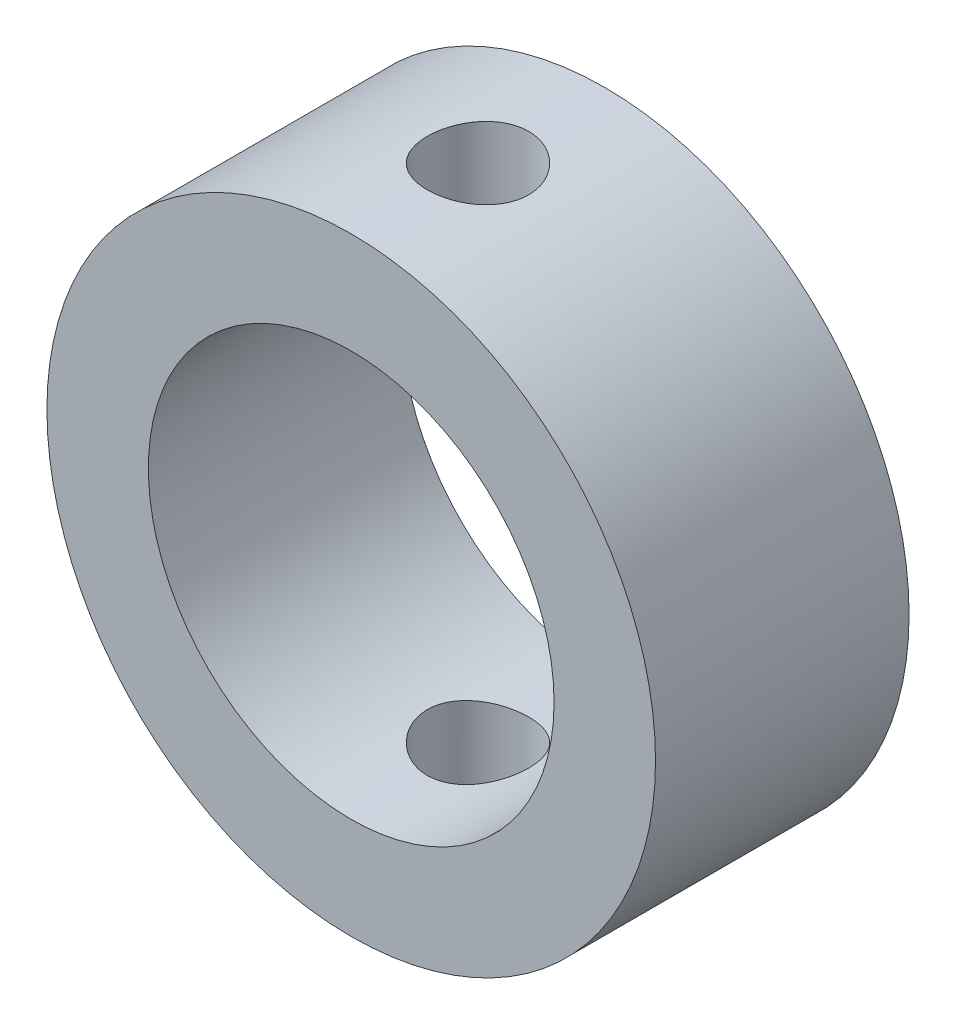
ISO-10303-21;
HEADER;
FILE_DESCRIPTION(('STEP AP214'),'2;1');
FILE_NAME('part.step','',(''),(''),'','','');
FILE_SCHEMA(('AUTOMOTIVE_DESIGN { 1 0 10303 214 1 1 1 1 }'));
ENDSEC;
DATA;
#1=APPLICATION_CONTEXT('core data for automotive mechanical design processes');
#2=APPLICATION_PROTOCOL_DEFINITION('international standard','automotive_design',2000,#1);
#3=PRODUCT_CONTEXT('',#1,'mechanical');
#4=PRODUCT('Part','Part','',(#3));
#5=PRODUCT_RELATED_PRODUCT_CATEGORY('part','',(#4));
#6=PRODUCT_DEFINITION_FORMATION('','',#4);
#7=PRODUCT_DEFINITION_CONTEXT('part definition',#1,'design');
#8=PRODUCT_DEFINITION('design','',#6,#7);
#9=PRODUCT_DEFINITION_SHAPE('','',#8);
#10=(LENGTH_UNIT() NAMED_UNIT(*) SI_UNIT(.MILLI.,.METRE.));
#11=(NAMED_UNIT(*) PLANE_ANGLE_UNIT() SI_UNIT($,.RADIAN.));
#12=(NAMED_UNIT(*) SI_UNIT($,.STERADIAN.) SOLID_ANGLE_UNIT());
#13=UNCERTAINTY_MEASURE_WITH_UNIT(LENGTH_MEASURE(1.E-05),#10,'distance_accuracy_value','');
#14=(GEOMETRIC_REPRESENTATION_CONTEXT(3) GLOBAL_UNCERTAINTY_ASSIGNED_CONTEXT((#13)) GLOBAL_UNIT_ASSIGNED_CONTEXT((#10,
#11,#12)) REPRESENTATION_CONTEXT('',''));
#15=CARTESIAN_POINT('',(0.,0.,0.));
#16=DIRECTION('',(0.,0.,1.));
#17=DIRECTION('',(1.,0.,0.));
#18=AXIS2_PLACEMENT_3D('',#15,#16,#17);
#19=CARTESIAN_POINT('',(0.,0.,7.5));
#20=DIRECTION('',(0.,0.,-1.));
#21=DIRECTION('',(-1.,0.,0.));
#22=AXIS2_PLACEMENT_3D('',#19,#20,#21);
#23=CYLINDRICAL_SURFACE('',#22,9.);
#24=CARTESIAN_POINT('',(0.,-9.,2.25));
#25=CARTESIAN_POINT('',(0.0836345429749289,-8.99999856701294,2.25000335336869));
#26=CARTESIAN_POINT('',(0.167314729103293,-8.9988220674782,2.25701836498135));
#27=CARTESIAN_POINT('',(0.332328133003826,-8.99424206964832,2.28488139525919));
#28=CARTESIAN_POINT('',(0.413659120775548,-8.99083652354334,2.30574213414696));
#29=CARTESIAN_POINT('',(0.571562848327586,-8.9821804094187,2.36064926915565));
#30=CARTESIAN_POINT('',(0.648139421059141,-8.97693135095516,2.39468487938434));
#31=CARTESIAN_POINT('',(0.794485105186767,-8.96516536249242,2.47494737523144));
#32=CARTESIAN_POINT('',(0.864254993927155,-8.9586485775266,2.5211728664898));
#33=CARTESIAN_POINT('',(0.995683568575008,-8.94499990474988,2.62497305029228));
#34=CARTESIAN_POINT('',(1.05726774212098,-8.93786323088914,2.68264146878168));
#35=CARTESIAN_POINT('',(1.16993309919596,-8.92381576126039,2.80748878108369));
#36=CARTESIAN_POINT('',(1.22101361963458,-8.916904979776,2.87466827487397));
#37=CARTESIAN_POINT('',(1.31152027536308,-8.90404539455868,3.01714257971823));
#38=CARTESIAN_POINT('',(1.3508727317166,-8.89810277454982,3.09248480208285));
#39=CARTESIAN_POINT('',(1.41633501924673,-8.88791873876805,3.24882573858038));
#40=CARTESIAN_POINT('',(1.44244574493937,-8.88367720808584,3.32982407020658));
#41=CARTESIAN_POINT('',(1.48044862667088,-8.87742322105653,3.49438816491392));
#42=CARTESIAN_POINT('',(1.49246941748124,-8.8753906109142,3.57792344190083));
#43=CARTESIAN_POINT('',(1.50235003517393,-8.87372363361989,3.74584816613008));
#44=CARTESIAN_POINT('',(1.5002108642334,-8.87408909674328,3.83023755250038));
#45=CARTESIAN_POINT('',(1.48193705903769,-8.87715857318133,3.99655671676527));
#46=CARTESIAN_POINT('',(1.46594692913386,-8.8798384399135,4.07850288212714));
#47=CARTESIAN_POINT('',(1.42065188424207,-8.88719697126605,4.23853279069748));
#48=CARTESIAN_POINT('',(1.39134651259184,-8.89187570443963,4.31661640133313));
#49=CARTESIAN_POINT('',(1.32010634765635,-8.9027308760046,4.46713729406455));
#50=CARTESIAN_POINT('',(1.27811154832783,-8.90891440264395,4.53954564364874));
#51=CARTESIAN_POINT('',(1.18272721053446,-8.92207751049005,4.67634264032303));
#52=CARTESIAN_POINT('',(1.12933675239257,-8.92905715592572,4.74073063947296));
#53=CARTESIAN_POINT('',(1.01188932729543,-8.94313216727871,4.86049565148441));
#54=CARTESIAN_POINT('',(0.947708378323876,-8.95022789538991,4.91575111112405));
#55=CARTESIAN_POINT('',(0.810921149388988,-8.96365560838034,5.0147266575992));
#56=CARTESIAN_POINT('',(0.738314815143853,-8.96998758833847,5.05844667010994));
#57=CARTESIAN_POINT('',(0.586623549700026,-8.98118335735747,5.13312133628177));
#58=CARTESIAN_POINT('',(0.507533235338796,-8.98604591044468,5.16406525159875));
#59=CARTESIAN_POINT('',(0.345179007361638,-8.99374501807596,5.21219652914759));
#60=CARTESIAN_POINT('',(0.26191544350768,-8.99658174210284,5.22938504218423));
#61=CARTESIAN_POINT('',(0.0946259407809739,-8.99988677905612,5.24935281507668));
#62=CARTESIAN_POINT('',(0.0106204422906067,-9.00038251807671,5.25229894308336));
#63=CARTESIAN_POINT('',(-0.156683863733933,-8.99902484652702,5.24414319334313));
#64=CARTESIAN_POINT('',(-0.239982698335223,-8.99717152634471,5.23304185611976));
#65=CARTESIAN_POINT('',(-0.402993705328058,-8.99134096162921,5.19724509039871));
#66=CARTESIAN_POINT('',(-0.482724521031228,-8.98737662880787,5.17263227496592));
#67=CARTESIAN_POINT('',(-0.636928130916266,-8.97776678673215,5.11059928908028));
#68=CARTESIAN_POINT('',(-0.711400629545831,-8.97212118307212,5.07317839941884));
#69=CARTESIAN_POINT('',(-0.853698413681375,-8.95970709781444,4.98620932518193));
#70=CARTESIAN_POINT('',(-0.92145915056229,-8.95292913532213,4.93655690629965));
#71=CARTESIAN_POINT('',(-1.04774615130161,-8.93903080435141,4.82667761076896));
#72=CARTESIAN_POINT('',(-1.10627174381795,-8.93191041102928,4.766449966034));
#73=CARTESIAN_POINT('',(-1.2130456677948,-8.91804105141507,4.63638147115714));
#74=CARTESIAN_POINT('',(-1.26118125666823,-8.91129669682264,4.56644750069135));
#75=CARTESIAN_POINT('',(-1.34502138617699,-8.8990291786673,4.41938821851688));
#76=CARTESIAN_POINT('',(-1.38072632086189,-8.89350597639612,4.3422631348635));
#77=CARTESIAN_POINT('',(-1.43852299888389,-8.88434072218623,4.18332616031272));
#78=CARTESIAN_POINT('',(-1.46067085952877,-8.88069092586639,4.10153514298171));
#79=CARTESIAN_POINT('',(-1.49090127226697,-8.87566630101156,3.93532792246694));
#80=CARTESIAN_POINT('',(-1.4989850471677,-8.87429127469633,3.85091194816077));
#81=CARTESIAN_POINT('',(-1.50082371962841,-8.87398039850407,3.68297690042255));
#82=CARTESIAN_POINT('',(-1.49475608167511,-8.8750143390339,3.59945977285483));
#83=CARTESIAN_POINT('',(-1.46884790337411,-8.87933868872237,3.43465245116954));
#84=CARTESIAN_POINT('',(-1.44900740766749,-8.88262909056728,3.35336224983488));
#85=CARTESIAN_POINT('',(-1.39618469375694,-8.89108413769031,3.19538493762443));
#86=CARTESIAN_POINT('',(-1.36321775436026,-8.89624660331802,3.11869259396638));
#87=CARTESIAN_POINT('',(-1.28509620234954,-8.90786621353324,2.97189859848309));
#88=CARTESIAN_POINT('',(-1.23994098524914,-8.91432342233039,2.90179727377672));
#89=CARTESIAN_POINT('',(-1.13809133062329,-8.92790072427373,2.76927865013535));
#90=CARTESIAN_POINT('',(-1.08126633815619,-8.93502777345781,2.70696238997983));
#91=CARTESIAN_POINT('',(-0.957965418828137,-8.94908623416505,2.59268903731504));
#92=CARTESIAN_POINT('',(-0.891487267747581,-8.95601760015928,2.5407343388171));
#93=CARTESIAN_POINT('',(-0.750221501784168,-8.96895917785332,2.44833103908003));
#94=CARTESIAN_POINT('',(-0.67537967251969,-8.97496269751862,2.40796437641223));
#95=CARTESIAN_POINT('',(-0.519907841627388,-8.98530700561065,2.34043830923405));
#96=CARTESIAN_POINT('',(-0.439283696898005,-8.98964944906489,2.31326575135218));
#97=CARTESIAN_POINT('',(-0.29862198602724,-8.99523474499773,2.278796835524));
#98=CARTESIAN_POINT('',(-0.239435298179068,-8.99701216364015,2.26801531823042));
#99=CARTESIAN_POINT('',(-0.120173586191886,-8.99939529591672,2.25361575729315));
#100=CARTESIAN_POINT('',(-0.0600985773650967,-9.00000102972385,2.24999759031758));
#101=CARTESIAN_POINT('',(0.,-9.,2.25));
#102=B_SPLINE_CURVE_WITH_KNOTS('',3,(#24,#25,#26,#27,#28,#29,#30,#31,#32,#33,#34,#35,#36,#37,
#38,#39,#40,#41,#42,#43,#44,#45,#46,#47,#48,#49,#50,#51,#52,#53,#54,#55,#56,#57,#58,#59,#60,#61,
#62,#63,#64,#65,#66,#67,#68,#69,#70,#71,#72,#73,#74,#75,#76,#77,#78,#79,#80,#81,#82,#83,#84,#85,
#86,#87,#88,#89,#90,#91,#92,#93,#94,#95,#96,#97,#98,#99,#100,#101),.UNSPECIFIED.,.T.,.F.,(4,2,2,
2,2,2,2,2,2,2,2,2,2,2,2,2,2,2,2,2,2,2,2,2,2,2,2,2,2,2,2,2,2,2,2,2,2,2,4),(0.,0.250683950963106,
0.501598527417252,0.752308120215163,1.00298904760487,1.25581494637399,1.50865680101914,
1.76305512494304,2.01743626125709,2.26947646262054,2.52149882592532,2.77092313056245,
3.02035599015229,3.27098733979535,3.52163892408344,3.77539661946796,4.02915594981509,
4.28312813349542,4.53707906712689,4.78804730094838,5.03900587821516,5.2884468420385,
5.5379018149564,5.78956095376215,6.0412383783257,6.29552293204572,6.54979942425566,
6.80301613405064,7.05621082671971,7.30624745713621,7.5562832771288,7.80602890935734,
8.05578693017602,8.30850830516036,8.56128800327384,8.8158133896432,9.07008451278043,
9.25022548898411,9.43036336366181),.UNSPECIFIED.);
#103=CARTESIAN_POINT('',(0.,-9.,2.25));
#104=VERTEX_POINT('',#103);
#105=EDGE_CURVE('E70',#104,#104,#102,.T.);
#106=ORIENTED_EDGE('',*,*,#105,.F.);
#107=EDGE_LOOP('',(#106));
#108=FACE_BOUND('',#107,.T.);
#109=CARTESIAN_POINT('',(0.,0.,7.5));
#110=DIRECTION('',(0.,0.,1.));
#111=DIRECTION('',(1.,0.,0.));
#112=AXIS2_PLACEMENT_3D('',#109,#110,#111);
#113=CIRCLE('',#112,9.);
#114=CARTESIAN_POINT('',(9.,0.,7.5));
#115=VERTEX_POINT('',#114);
#116=EDGE_CURVE('E10',#115,#115,#113,.T.);
#117=ORIENTED_EDGE('',*,*,#116,.F.);
#118=EDGE_LOOP('',(#117));
#119=FACE_BOUND('',#118,.T.);
#120=CARTESIAN_POINT('',(0.,0.,0.));
#121=DIRECTION('',(0.,0.,1.));
#122=DIRECTION('',(1.,0.,0.));
#123=AXIS2_PLACEMENT_3D('',#120,#121,#122);
#124=CIRCLE('',#123,9.);
#125=CARTESIAN_POINT('',(9.,0.,0.));
#126=VERTEX_POINT('',#125);
#127=EDGE_CURVE('E43',#126,#126,#124,.T.);
#128=ORIENTED_EDGE('',*,*,#127,.T.);
#129=EDGE_LOOP('',(#128));
#130=FACE_BOUND('',#129,.T.);
#131=CARTESIAN_POINT('',(0.,9.,2.25));
#132=CARTESIAN_POINT('',(-0.0836345429749289,8.99999856701294,2.25000335336869));
#133=CARTESIAN_POINT('',(-0.167314729103293,8.9988220674782,2.25701836498135));
#134=CARTESIAN_POINT('',(-0.332328133003826,8.99424206964832,2.28488139525919));
#135=CARTESIAN_POINT('',(-0.413659120775548,8.99083652354334,2.30574213414696));
#136=CARTESIAN_POINT('',(-0.571562848327586,8.9821804094187,2.36064926915565));
#137=CARTESIAN_POINT('',(-0.648139421059141,8.97693135095516,2.39468487938434));
#138=CARTESIAN_POINT('',(-0.794485105186767,8.96516536249242,2.47494737523144));
#139=CARTESIAN_POINT('',(-0.864254993927155,8.9586485775266,2.5211728664898));
#140=CARTESIAN_POINT('',(-0.995683568575008,8.94499990474988,2.62497305029228));
#141=CARTESIAN_POINT('',(-1.05726774212098,8.93786323088914,2.68264146878168));
#142=CARTESIAN_POINT('',(-1.16993309919596,8.92381576126039,2.80748878108369));
#143=CARTESIAN_POINT('',(-1.22101361963458,8.916904979776,2.87466827487397));
#144=CARTESIAN_POINT('',(-1.31152027536308,8.90404539455868,3.01714257971823));
#145=CARTESIAN_POINT('',(-1.3508727317166,8.89810277454982,3.09248480208285));
#146=CARTESIAN_POINT('',(-1.41633501924673,8.88791873876805,3.24882573858038));
#147=CARTESIAN_POINT('',(-1.44244574493937,8.88367720808584,3.32982407020658));
#148=CARTESIAN_POINT('',(-1.48044862667088,8.87742322105653,3.49438816491392));
#149=CARTESIAN_POINT('',(-1.49246941748124,8.8753906109142,3.57792344190083));
#150=CARTESIAN_POINT('',(-1.50235003517393,8.87372363361989,3.74584816613008));
#151=CARTESIAN_POINT('',(-1.5002108642334,8.87408909674328,3.83023755250038));
#152=CARTESIAN_POINT('',(-1.48193705903769,8.87715857318133,3.99655671676527));
#153=CARTESIAN_POINT('',(-1.46594692913386,8.8798384399135,4.07850288212714));
#154=CARTESIAN_POINT('',(-1.42065188424207,8.88719697126605,4.23853279069748));
#155=CARTESIAN_POINT('',(-1.39134651259184,8.89187570443963,4.31661640133313));
#156=CARTESIAN_POINT('',(-1.32010634765635,8.9027308760046,4.46713729406455));
#157=CARTESIAN_POINT('',(-1.27811154832783,8.90891440264395,4.53954564364874));
#158=CARTESIAN_POINT('',(-1.18272721053446,8.92207751049005,4.67634264032303));
#159=CARTESIAN_POINT('',(-1.12933675239257,8.92905715592572,4.74073063947296));
#160=CARTESIAN_POINT('',(-1.01188932729543,8.94313216727871,4.86049565148441));
#161=CARTESIAN_POINT('',(-0.947708378323876,8.95022789538991,4.91575111112405));
#162=CARTESIAN_POINT('',(-0.810921149388988,8.96365560838034,5.0147266575992));
#163=CARTESIAN_POINT('',(-0.738314815143853,8.96998758833847,5.05844667010994));
#164=CARTESIAN_POINT('',(-0.586623549700026,8.98118335735747,5.13312133628177));
#165=CARTESIAN_POINT('',(-0.507533235338796,8.98604591044468,5.16406525159875));
#166=CARTESIAN_POINT('',(-0.345179007361638,8.99374501807596,5.21219652914759));
#167=CARTESIAN_POINT('',(-0.26191544350768,8.99658174210284,5.22938504218423));
#168=CARTESIAN_POINT('',(-0.0946259407809739,8.99988677905612,5.24935281507668));
#169=CARTESIAN_POINT('',(-0.0106204422906067,9.00038251807671,5.25229894308336));
#170=CARTESIAN_POINT('',(0.156683863733933,8.99902484652702,5.24414319334313));
#171=CARTESIAN_POINT('',(0.239982698335223,8.99717152634471,5.23304185611976));
#172=CARTESIAN_POINT('',(0.402993705328058,8.99134096162921,5.19724509039871));
#173=CARTESIAN_POINT('',(0.482724521031228,8.98737662880787,5.17263227496592));
#174=CARTESIAN_POINT('',(0.636928130916266,8.97776678673215,5.11059928908028));
#175=CARTESIAN_POINT('',(0.711400629545831,8.97212118307212,5.07317839941884));
#176=CARTESIAN_POINT('',(0.853698413681375,8.95970709781444,4.98620932518193));
#177=CARTESIAN_POINT('',(0.92145915056229,8.95292913532213,4.93655690629965));
#178=CARTESIAN_POINT('',(1.04774615130161,8.93903080435141,4.82667761076896));
#179=CARTESIAN_POINT('',(1.10627174381795,8.93191041102928,4.766449966034));
#180=CARTESIAN_POINT('',(1.2130456677948,8.91804105141507,4.63638147115714));
#181=CARTESIAN_POINT('',(1.26118125666823,8.91129669682264,4.56644750069135));
#182=CARTESIAN_POINT('',(1.34502138617699,8.8990291786673,4.41938821851688));
#183=CARTESIAN_POINT('',(1.38072632086189,8.89350597639612,4.3422631348635));
#184=CARTESIAN_POINT('',(1.43852299888389,8.88434072218623,4.18332616031272));
#185=CARTESIAN_POINT('',(1.46067085952877,8.88069092586639,4.10153514298171));
#186=CARTESIAN_POINT('',(1.49090127226697,8.87566630101156,3.93532792246694));
#187=CARTESIAN_POINT('',(1.4989850471677,8.87429127469633,3.85091194816077));
#188=CARTESIAN_POINT('',(1.50082371962841,8.87398039850407,3.68297690042255));
#189=CARTESIAN_POINT('',(1.49475608167511,8.8750143390339,3.59945977285483));
#190=CARTESIAN_POINT('',(1.46884790337411,8.87933868872237,3.43465245116954));
#191=CARTESIAN_POINT('',(1.44900740766749,8.88262909056728,3.35336224983488));
#192=CARTESIAN_POINT('',(1.39618469375694,8.89108413769031,3.19538493762443));
#193=CARTESIAN_POINT('',(1.36321775436026,8.89624660331802,3.11869259396638));
#194=CARTESIAN_POINT('',(1.28509620234954,8.90786621353324,2.97189859848309));
#195=CARTESIAN_POINT('',(1.23994098524914,8.91432342233039,2.90179727377672));
#196=CARTESIAN_POINT('',(1.13809133062329,8.92790072427373,2.76927865013535));
#197=CARTESIAN_POINT('',(1.08126633815619,8.93502777345781,2.70696238997983));
#198=CARTESIAN_POINT('',(0.957965418828137,8.94908623416505,2.59268903731504));
#199=CARTESIAN_POINT('',(0.891487267747581,8.95601760015928,2.5407343388171));
#200=CARTESIAN_POINT('',(0.750221501784168,8.96895917785332,2.44833103908003));
#201=CARTESIAN_POINT('',(0.67537967251969,8.97496269751862,2.40796437641223));
#202=CARTESIAN_POINT('',(0.519907841627388,8.98530700561065,2.34043830923405));
#203=CARTESIAN_POINT('',(0.439283696898005,8.98964944906489,2.31326575135218));
#204=CARTESIAN_POINT('',(0.29862198602724,8.99523474499773,2.278796835524));
#205=CARTESIAN_POINT('',(0.239435298179068,8.99701216364015,2.26801531823042));
#206=CARTESIAN_POINT('',(0.120173586191886,8.99939529591672,2.25361575729315));
#207=CARTESIAN_POINT('',(0.0600985773650967,9.00000102972385,2.24999759031758));
#208=CARTESIAN_POINT('',(0.,9.,2.25));
#209=B_SPLINE_CURVE_WITH_KNOTS('',3,(#131,#132,#133,#134,#135,#136,#137,#138,#139,#140,#141,
#142,#143,#144,#145,#146,#147,#148,#149,#150,#151,#152,#153,#154,#155,#156,#157,#158,#159,#160,
#161,#162,#163,#164,#165,#166,#167,#168,#169,#170,#171,#172,#173,#174,#175,#176,#177,#178,#179,
#180,#181,#182,#183,#184,#185,#186,#187,#188,#189,#190,#191,#192,#193,#194,#195,#196,#197,#198,
#199,#200,#201,#202,#203,#204,#205,#206,#207,#208),.UNSPECIFIED.,.T.,.F.,(4,2,2,2,2,2,2,2,2,2,2,
2,2,2,2,2,2,2,2,2,2,2,2,2,2,2,2,2,2,2,2,2,2,2,2,2,2,2,4),(0.,0.250683950963106,
0.501598527417252,0.752308120215163,1.00298904760487,1.25581494637399,1.50865680101914,
1.76305512494304,2.01743626125709,2.26947646262054,2.52149882592532,2.77092313056245,
3.02035599015229,3.27098733979535,3.52163892408344,3.77539661946796,4.02915594981509,
4.28312813349542,4.53707906712689,4.78804730094838,5.03900587821516,5.2884468420385,
5.5379018149564,5.78956095376215,6.0412383783257,6.29552293204572,6.54979942425566,
6.80301613405064,7.05621082671971,7.30624745713621,7.5562832771288,7.80602890935734,
8.05578693017602,8.30850830516036,8.56128800327384,8.8158133896432,9.07008451278043,
9.25022548898411,9.43036336366181),.UNSPECIFIED.);
#210=CARTESIAN_POINT('',(0.,9.,2.25));
#211=VERTEX_POINT('',#210);
#212=EDGE_CURVE('E74',#211,#211,#209,.T.);
#213=ORIENTED_EDGE('',*,*,#212,.F.);
#214=EDGE_LOOP('',(#213));
#215=FACE_BOUND('',#214,.T.);
#216=ADVANCED_FACE('F31',(#108,#119,#130,#215),#23,.T.);
#217=CARTESIAN_POINT('',(0.,0.,7.5));
#218=DIRECTION('',(0.,0.,-1.));
#219=DIRECTION('',(-1.,0.,0.));
#220=AXIS2_PLACEMENT_3D('',#217,#218,#219);
#221=CYLINDRICAL_SURFACE('',#220,6.);
#222=CARTESIAN_POINT('',(0.,-6.,2.25));
#223=CARTESIAN_POINT('',(0.082876088669731,-5.99999859868013,2.25000232573816));
#224=CARTESIAN_POINT('',(0.165778157830763,-5.99826578131829,2.25689155077379));
#225=CARTESIAN_POINT('',(0.329206323770533,-5.99152113829893,2.284225151307));
#226=CARTESIAN_POINT('',(0.409731046870739,-5.98650745419969,2.30467720953785));
#227=CARTESIAN_POINT('',(0.566020872182577,-5.9737562633204,2.35843925346209));
#228=CARTESIAN_POINT('',(0.641791563430003,-5.96602202842087,2.39173379871528));
#229=CARTESIAN_POINT('',(0.786672131904427,-5.94865343807593,2.47018139004483));
#230=CARTESIAN_POINT('',(0.855781784348759,-5.93901901854051,2.51533483611894));
#231=CARTESIAN_POINT('',(0.98680192730092,-5.91867413591802,2.61720078965421));
#232=CARTESIAN_POINT('',(1.04855569006107,-5.90794707148533,2.67411157495918));
#233=CARTESIAN_POINT('',(1.1617489272033,-5.8867362011753,2.79745220490892));
#234=CARTESIAN_POINT('',(1.21318723694913,-5.87625242288349,2.8638831229465));
#235=CARTESIAN_POINT('',(1.30502654279903,-5.85654775699711,3.00559522673744));
#236=CARTESIAN_POINT('',(1.34525221592536,-5.84734794470605,3.0809932308104));
#237=CARTESIAN_POINT('',(1.41239690855053,-5.83149494812223,3.23774841165836));
#238=CARTESIAN_POINT('',(1.43931805543933,-5.82484135672789,3.31910463332576));
#239=CARTESIAN_POINT('',(1.47855483680429,-5.81500476717551,3.48374349820247));
#240=CARTESIAN_POINT('',(1.49115226833334,-5.81175491075426,3.5669548960498));
#241=CARTESIAN_POINT('',(1.50226177506785,-5.80889362537741,3.73436856901398));
#242=CARTESIAN_POINT('',(1.50077614181798,-5.80928160448644,3.81857068069861));
#243=CARTESIAN_POINT('',(1.48398652463928,-5.81359205496618,3.98341580774448));
#244=CARTESIAN_POINT('',(1.46901834019052,-5.81742863001879,4.0640956214651));
#245=CARTESIAN_POINT('',(1.42622418690311,-5.82806709676484,4.22176105091129));
#246=CARTESIAN_POINT('',(1.39839730206942,-5.83486919970697,4.29874640302898));
#247=CARTESIAN_POINT('',(1.33038947793715,-5.85075113904187,4.44773801625207));
#248=CARTESIAN_POINT('',(1.29008666723291,-5.85985327469421,4.51968617178955));
#249=CARTESIAN_POINT('',(1.19835627601495,-5.87929710846386,4.65591870975684));
#250=CARTESIAN_POINT('',(1.14692674880884,-5.88963902334736,4.72020174806725));
#251=CARTESIAN_POINT('',(1.03266342468122,-5.91075880539781,4.8412036156944));
#252=CARTESIAN_POINT('',(0.96954625816586,-5.92154069477972,4.89765449006135));
#253=CARTESIAN_POINT('',(0.8346119175037,-5.94205965578786,4.9992212424639));
#254=CARTESIAN_POINT('',(0.762794477707943,-5.95179669549416,5.04433677426357));
#255=CARTESIAN_POINT('',(0.612115888681391,-5.96917732094183,5.12205058622439));
#256=CARTESIAN_POINT('',(0.533231393208623,-5.97681360127725,5.15460534025443));
#257=CARTESIAN_POINT('',(0.370876008142883,-5.98907916991419,5.20591730570957));
#258=CARTESIAN_POINT('',(0.287405999150485,-5.99370903339281,5.22467715641814));
#259=CARTESIAN_POINT('',(0.120539970390027,-5.99935499271375,5.24745756555884));
#260=CARTESIAN_POINT('',(0.0371967199882102,-6.00046053508279,5.2518430260753));
#261=CARTESIAN_POINT('',(-0.129032874801508,-5.99918804814451,5.24675099794451));
#262=CARTESIAN_POINT('',(-0.211919259644595,-5.99681033241847,5.23727475720087));
#263=CARTESIAN_POINT('',(-0.373614268776491,-5.98889581127357,5.20502909160862));
#264=CARTESIAN_POINT('',(-0.452465118968754,-5.98340634185811,5.18245873652301));
#265=CARTESIAN_POINT('',(-0.605257292452511,-5.96988706634134,5.12489291597155));
#266=CARTESIAN_POINT('',(-0.679198119032634,-5.96185700369892,5.08989619568683));
#267=CARTESIAN_POINT('',(-0.821523134429847,-5.94393307926311,5.00776387112527));
#268=CARTESIAN_POINT('',(-0.88978544183583,-5.93400867366932,4.96042388760324));
#269=CARTESIAN_POINT('',(-1.01752661364325,-5.91344509187419,4.85521009120303));
#270=CARTESIAN_POINT('',(-1.07700395897301,-5.90280579251705,4.79733446038309));
#271=CARTESIAN_POINT('',(-1.18699056807273,-5.88168956960771,4.67099803915554));
#272=CARTESIAN_POINT('',(-1.23724386762203,-5.87122304187281,4.60231229699758));
#273=CARTESIAN_POINT('',(-1.3255107590127,-5.85192878377239,4.45726736553428));
#274=CARTESIAN_POINT('',(-1.36352489415794,-5.84310098067026,4.38090851704025));
#275=CARTESIAN_POINT('',(-1.42595142060929,-5.82818094734665,4.22309427758692));
#276=CARTESIAN_POINT('',(-1.45044439665406,-5.82207255291906,4.14167237165599));
#277=CARTESIAN_POINT('',(-1.48534565995378,-5.81326744090184,3.97569036211089));
#278=CARTESIAN_POINT('',(-1.49575702747866,-5.81056997719936,3.89113094896751));
#279=CARTESIAN_POINT('',(-1.50203859033399,-5.80894901203957,3.7238789761448));
#280=CARTESIAN_POINT('',(-1.49831789778012,-5.80991932728264,3.64120256487527));
#281=CARTESIAN_POINT('',(-1.47737727831287,-5.81527909007843,3.47769611133202));
#282=CARTESIAN_POINT('',(-1.46015762268677,-5.81966846891857,3.39686603198635));
#283=CARTESIAN_POINT('',(-1.41293131944279,-5.83131260682723,3.23979154093459));
#284=CARTESIAN_POINT('',(-1.38300140468038,-5.8385501523631,3.16352269475979));
#285=CARTESIAN_POINT('',(-1.31126491360507,-5.85507755724829,3.01703461728631));
#286=CARTESIAN_POINT('',(-1.26945669003419,-5.86436770120773,2.94681622681308));
#287=CARTESIAN_POINT('',(-1.17386774863714,-5.88425634263512,2.81244537099798));
#288=CARTESIAN_POINT('',(-1.11980316291225,-5.89488264831757,2.74849892657604));
#289=CARTESIAN_POINT('',(-1.00178937118973,-5.91608027246286,2.63045295520459));
#290=CARTESIAN_POINT('',(-0.937837821261145,-5.9266515772706,2.57635576988703));
#291=CARTESIAN_POINT('',(-0.80046758670259,-5.94677655647663,2.47858869143539));
#292=CARTESIAN_POINT('',(-0.726898422316387,-5.95630833365868,2.43512538632842));
#293=CARTESIAN_POINT('',(-0.573266059510477,-5.97304924975119,2.36125253705947));
#294=CARTESIAN_POINT('',(-0.49320756343674,-5.98026005199782,2.33083363935146));
#295=CARTESIAN_POINT('',(-0.344410253243472,-5.99048059565542,2.28842816967035));
#296=CARTESIAN_POINT('',(-0.276380170908069,-5.99402585052691,2.27404875694657));
#297=CARTESIAN_POINT('',(-0.138906071536283,-5.99878605231949,2.25483405637806));
#298=CARTESIAN_POINT('',(-0.0694621612426163,-6.00000117450894,2.2499980506947));
#299=CARTESIAN_POINT('',(0.,-6.,2.25));
#300=B_SPLINE_CURVE_WITH_KNOTS('',3,(#222,#223,#224,#225,#226,#227,#228,#229,#230,#231,#232,
#233,#234,#235,#236,#237,#238,#239,#240,#241,#242,#243,#244,#245,#246,#247,#248,#249,#250,#251,
#252,#253,#254,#255,#256,#257,#258,#259,#260,#261,#262,#263,#264,#265,#266,#267,#268,#269,#270,
#271,#272,#273,#274,#275,#276,#277,#278,#279,#280,#281,#282,#283,#284,#285,#286,#287,#288,#289,
#290,#291,#292,#293,#294,#295,#296,#297,#298,#299),.UNSPECIFIED.,.T.,.F.,(4,2,2,2,2,2,2,2,2,2,2,
2,2,2,2,2,2,2,2,2,2,2,2,2,2,2,2,2,2,2,2,2,2,2,2,2,2,2,4),(0.,0.24837371247189,0.4968882377639,
0.745104902286106,0.993329940169328,1.24614435437139,1.49898729580062,1.75558647545807,
2.01214461169368,2.2635629509943,2.51494038112697,2.76022497007018,3.00552703466038,
3.25330527873879,3.50112690836163,3.75601500969019,4.01091089558247,4.26668229009114,
4.52240473688643,4.77158308949276,5.02073901112743,5.26620274514037,5.5116912732229,
5.76153587565352,6.01142363008019,6.26744509204476,6.52345518749508,6.77792254614036,
7.03233423252408,7.27943780398612,7.52653640956034,7.77216400559447,8.01782568136901,
8.2698957640991,8.52202569770417,8.77872185499588,9.0352336382135,9.24342242942149,
9.45159556043039),.UNSPECIFIED.);
#301=CARTESIAN_POINT('',(0.,-6.,2.25));
#302=VERTEX_POINT('',#301);
#303=EDGE_CURVE('E53',#302,#302,#300,.T.);
#304=ORIENTED_EDGE('',*,*,#303,.T.);
#305=EDGE_LOOP('',(#304));
#306=FACE_BOUND('',#305,.T.);
#307=CARTESIAN_POINT('',(0.,0.,7.5));
#308=DIRECTION('',(0.,0.,1.));
#309=DIRECTION('',(1.,0.,0.));
#310=AXIS2_PLACEMENT_3D('',#307,#308,#309);
#311=CIRCLE('',#310,6.);
#312=CARTESIAN_POINT('',(6.,0.,7.5));
#313=VERTEX_POINT('',#312);
#314=EDGE_CURVE('E48',#313,#313,#311,.T.);
#315=ORIENTED_EDGE('',*,*,#314,.T.);
#316=EDGE_LOOP('',(#315));
#317=FACE_BOUND('',#316,.T.);
#318=CARTESIAN_POINT('',(0.,0.,0.));
#319=DIRECTION('',(0.,0.,1.));
#320=DIRECTION('',(1.,0.,0.));
#321=AXIS2_PLACEMENT_3D('',#318,#319,#320);
#322=CIRCLE('',#321,6.);
#323=CARTESIAN_POINT('',(6.,0.,0.));
#324=VERTEX_POINT('',#323);
#325=EDGE_CURVE('E51',#324,#324,#322,.T.);
#326=ORIENTED_EDGE('',*,*,#325,.F.);
#327=EDGE_LOOP('',(#326));
#328=FACE_BOUND('',#327,.T.);
#329=CARTESIAN_POINT('',(0.,6.,2.25));
#330=CARTESIAN_POINT('',(-0.082876088669731,5.99999859868013,2.25000232573816));
#331=CARTESIAN_POINT('',(-0.165778157830763,5.99826578131829,2.25689155077379));
#332=CARTESIAN_POINT('',(-0.329206323770533,5.99152113829893,2.284225151307));
#333=CARTESIAN_POINT('',(-0.409731046870739,5.98650745419969,2.30467720953785));
#334=CARTESIAN_POINT('',(-0.566020872182577,5.9737562633204,2.35843925346209));
#335=CARTESIAN_POINT('',(-0.641791563430003,5.96602202842087,2.39173379871528));
#336=CARTESIAN_POINT('',(-0.786672131904427,5.94865343807593,2.47018139004483));
#337=CARTESIAN_POINT('',(-0.855781784348759,5.93901901854051,2.51533483611894));
#338=CARTESIAN_POINT('',(-0.98680192730092,5.91867413591802,2.61720078965421));
#339=CARTESIAN_POINT('',(-1.04855569006107,5.90794707148533,2.67411157495918));
#340=CARTESIAN_POINT('',(-1.1617489272033,5.8867362011753,2.79745220490892));
#341=CARTESIAN_POINT('',(-1.21318723694913,5.87625242288349,2.8638831229465));
#342=CARTESIAN_POINT('',(-1.30502654279903,5.85654775699711,3.00559522673744));
#343=CARTESIAN_POINT('',(-1.34525221592536,5.84734794470605,3.0809932308104));
#344=CARTESIAN_POINT('',(-1.41239690855053,5.83149494812223,3.23774841165836));
#345=CARTESIAN_POINT('',(-1.43931805543933,5.82484135672789,3.31910463332576));
#346=CARTESIAN_POINT('',(-1.47855483680429,5.81500476717551,3.48374349820247));
#347=CARTESIAN_POINT('',(-1.49115226833334,5.81175491075426,3.5669548960498));
#348=CARTESIAN_POINT('',(-1.50226177506785,5.80889362537741,3.73436856901398));
#349=CARTESIAN_POINT('',(-1.50077614181798,5.80928160448644,3.81857068069861));
#350=CARTESIAN_POINT('',(-1.48398652463928,5.81359205496618,3.98341580774448));
#351=CARTESIAN_POINT('',(-1.46901834019052,5.81742863001879,4.0640956214651));
#352=CARTESIAN_POINT('',(-1.42622418690311,5.82806709676484,4.22176105091129));
#353=CARTESIAN_POINT('',(-1.39839730206942,5.83486919970697,4.29874640302898));
#354=CARTESIAN_POINT('',(-1.33038947793715,5.85075113904187,4.44773801625207));
#355=CARTESIAN_POINT('',(-1.29008666723291,5.85985327469421,4.51968617178955));
#356=CARTESIAN_POINT('',(-1.19835627601495,5.87929710846386,4.65591870975684));
#357=CARTESIAN_POINT('',(-1.14692674880884,5.88963902334736,4.72020174806725));
#358=CARTESIAN_POINT('',(-1.03266342468122,5.91075880539781,4.8412036156944));
#359=CARTESIAN_POINT('',(-0.96954625816586,5.92154069477972,4.89765449006135));
#360=CARTESIAN_POINT('',(-0.8346119175037,5.94205965578786,4.9992212424639));
#361=CARTESIAN_POINT('',(-0.762794477707943,5.95179669549416,5.04433677426357));
#362=CARTESIAN_POINT('',(-0.612115888681391,5.96917732094183,5.12205058622439));
#363=CARTESIAN_POINT('',(-0.533231393208623,5.97681360127725,5.15460534025443));
#364=CARTESIAN_POINT('',(-0.370876008142883,5.98907916991419,5.20591730570957));
#365=CARTESIAN_POINT('',(-0.287405999150485,5.99370903339281,5.22467715641814));
#366=CARTESIAN_POINT('',(-0.120539970390027,5.99935499271375,5.24745756555884));
#367=CARTESIAN_POINT('',(-0.0371967199882102,6.00046053508279,5.2518430260753));
#368=CARTESIAN_POINT('',(0.129032874801508,5.99918804814451,5.24675099794451));
#369=CARTESIAN_POINT('',(0.211919259644595,5.99681033241847,5.23727475720087));
#370=CARTESIAN_POINT('',(0.373614268776491,5.98889581127357,5.20502909160862));
#371=CARTESIAN_POINT('',(0.452465118968754,5.98340634185811,5.18245873652301));
#372=CARTESIAN_POINT('',(0.605257292452511,5.96988706634134,5.12489291597155));
#373=CARTESIAN_POINT('',(0.679198119032634,5.96185700369892,5.08989619568683));
#374=CARTESIAN_POINT('',(0.821523134429847,5.94393307926311,5.00776387112527));
#375=CARTESIAN_POINT('',(0.88978544183583,5.93400867366932,4.96042388760324));
#376=CARTESIAN_POINT('',(1.01752661364325,5.91344509187419,4.85521009120303));
#377=CARTESIAN_POINT('',(1.07700395897301,5.90280579251705,4.79733446038309));
#378=CARTESIAN_POINT('',(1.18699056807273,5.88168956960771,4.67099803915554));
#379=CARTESIAN_POINT('',(1.23724386762203,5.87122304187281,4.60231229699758));
#380=CARTESIAN_POINT('',(1.3255107590127,5.85192878377239,4.45726736553428));
#381=CARTESIAN_POINT('',(1.36352489415794,5.84310098067026,4.38090851704025));
#382=CARTESIAN_POINT('',(1.42595142060929,5.82818094734665,4.22309427758692));
#383=CARTESIAN_POINT('',(1.45044439665406,5.82207255291906,4.14167237165599));
#384=CARTESIAN_POINT('',(1.48534565995378,5.81326744090184,3.97569036211089));
#385=CARTESIAN_POINT('',(1.49575702747866,5.81056997719936,3.89113094896751));
#386=CARTESIAN_POINT('',(1.50203859033399,5.80894901203957,3.7238789761448));
#387=CARTESIAN_POINT('',(1.49831789778012,5.80991932728264,3.64120256487527));
#388=CARTESIAN_POINT('',(1.47737727831287,5.81527909007843,3.47769611133202));
#389=CARTESIAN_POINT('',(1.46015762268677,5.81966846891857,3.39686603198635));
#390=CARTESIAN_POINT('',(1.41293131944279,5.83131260682723,3.23979154093459));
#391=CARTESIAN_POINT('',(1.38300140468038,5.8385501523631,3.16352269475979));
#392=CARTESIAN_POINT('',(1.31126491360507,5.85507755724829,3.01703461728631));
#393=CARTESIAN_POINT('',(1.26945669003419,5.86436770120773,2.94681622681308));
#394=CARTESIAN_POINT('',(1.17386774863714,5.88425634263512,2.81244537099798));
#395=CARTESIAN_POINT('',(1.11980316291225,5.89488264831757,2.74849892657604));
#396=CARTESIAN_POINT('',(1.00178937118973,5.91608027246286,2.63045295520459));
#397=CARTESIAN_POINT('',(0.937837821261145,5.9266515772706,2.57635576988703));
#398=CARTESIAN_POINT('',(0.80046758670259,5.94677655647663,2.47858869143539));
#399=CARTESIAN_POINT('',(0.726898422316387,5.95630833365868,2.43512538632842));
#400=CARTESIAN_POINT('',(0.573266059510477,5.97304924975119,2.36125253705947));
#401=CARTESIAN_POINT('',(0.49320756343674,5.98026005199782,2.33083363935146));
#402=CARTESIAN_POINT('',(0.344410253243472,5.99048059565542,2.28842816967035));
#403=CARTESIAN_POINT('',(0.276380170908069,5.99402585052691,2.27404875694657));
#404=CARTESIAN_POINT('',(0.138906071536283,5.99878605231949,2.25483405637806));
#405=CARTESIAN_POINT('',(0.0694621612426163,6.00000117450894,2.2499980506947));
#406=CARTESIAN_POINT('',(0.,6.,2.25));
#407=B_SPLINE_CURVE_WITH_KNOTS('',3,(#329,#330,#331,#332,#333,#334,#335,#336,#337,#338,#339,
#340,#341,#342,#343,#344,#345,#346,#347,#348,#349,#350,#351,#352,#353,#354,#355,#356,#357,#358,
#359,#360,#361,#362,#363,#364,#365,#366,#367,#368,#369,#370,#371,#372,#373,#374,#375,#376,#377,
#378,#379,#380,#381,#382,#383,#384,#385,#386,#387,#388,#389,#390,#391,#392,#393,#394,#395,#396,
#397,#398,#399,#400,#401,#402,#403,#404,#405,#406),.UNSPECIFIED.,.T.,.F.,(4,2,2,2,2,2,2,2,2,2,2,
2,2,2,2,2,2,2,2,2,2,2,2,2,2,2,2,2,2,2,2,2,2,2,2,2,2,2,4),(0.,0.24837371247189,0.4968882377639,
0.745104902286106,0.993329940169328,1.24614435437139,1.49898729580062,1.75558647545807,
2.01214461169368,2.2635629509943,2.51494038112697,2.76022497007018,3.00552703466038,
3.25330527873879,3.50112690836163,3.75601500969019,4.01091089558247,4.26668229009114,
4.52240473688643,4.77158308949276,5.02073901112743,5.26620274514037,5.5116912732229,
5.76153587565352,6.01142363008019,6.26744509204476,6.52345518749508,6.77792254614036,
7.03233423252408,7.27943780398612,7.52653640956034,7.77216400559447,8.01782568136901,
8.2698957640991,8.52202569770417,8.77872185499588,9.0352336382135,9.24342242942149,
9.45159556043039),.UNSPECIFIED.);
#408=CARTESIAN_POINT('',(0.,6.,2.25));
#409=VERTEX_POINT('',#408);
#410=EDGE_CURVE('E35',#409,#409,#407,.T.);
#411=ORIENTED_EDGE('',*,*,#410,.T.);
#412=EDGE_LOOP('',(#411));
#413=FACE_BOUND('',#412,.T.);
#414=ADVANCED_FACE('F57',(#306,#317,#328,#413),#221,.F.);
#415=CARTESIAN_POINT('',(0.,0.,7.5));
#416=DIRECTION('',(0.,0.,1.));
#417=DIRECTION('',(1.,0.,0.));
#418=AXIS2_PLACEMENT_3D('',#415,#416,#417);
#419=PLANE('',#418);
#420=ORIENTED_EDGE('',*,*,#116,.T.);
#421=EDGE_LOOP('',(#420));
#422=FACE_BOUND('',#421,.T.);
#423=ORIENTED_EDGE('',*,*,#314,.F.);
#424=EDGE_LOOP('',(#423));
#425=FACE_BOUND('',#424,.T.);
#426=ADVANCED_FACE('F88',(#422,#425),#419,.T.);
#427=CARTESIAN_POINT('',(0.,0.,0.));
#428=DIRECTION('',(0.,0.,1.));
#429=DIRECTION('',(1.,0.,0.));
#430=AXIS2_PLACEMENT_3D('',#427,#428,#429);
#431=PLANE('',#430);
#432=ORIENTED_EDGE('',*,*,#127,.F.);
#433=EDGE_LOOP('',(#432));
#434=FACE_BOUND('',#433,.T.);
#435=ORIENTED_EDGE('',*,*,#325,.T.);
#436=EDGE_LOOP('',(#435));
#437=FACE_BOUND('',#436,.T.);
#438=ADVANCED_FACE('F84',(#434,#437),#431,.F.);
#439=CARTESIAN_POINT('',(0.,10.,3.75));
#440=DIRECTION('',(0.,-1.,0.));
#441=DIRECTION('',(0.,0.,-1.));
#442=AXIS2_PLACEMENT_3D('',#439,#440,#441);
#443=CYLINDRICAL_SURFACE('',#442,1.5);
#444=ORIENTED_EDGE('',*,*,#303,.F.);
#445=EDGE_LOOP('',(#444));
#446=FACE_BOUND('',#445,.T.);
#447=ORIENTED_EDGE('',*,*,#105,.T.);
#448=EDGE_LOOP('',(#447));
#449=FACE_BOUND('',#448,.T.);
#450=ADVANCED_FACE('F63',(#446,#449),#443,.F.);
#451=ORIENTED_EDGE('',*,*,#410,.F.);
#452=EDGE_LOOP('',(#451));
#453=FACE_BOUND('',#452,.T.);
#454=ORIENTED_EDGE('',*,*,#212,.T.);
#455=EDGE_LOOP('',(#454));
#456=FACE_BOUND('',#455,.T.);
#457=ADVANCED_FACE('F60',(#453,#456),#443,.F.);
#458=CLOSED_SHELL('',(#216,#414,#426,#438,#450,#457));
#459=MANIFOLD_SOLID_BREP('B2',#458);
#460=ADVANCED_BREP_SHAPE_REPRESENTATION('',(#18,#459),#14);
#461=SHAPE_DEFINITION_REPRESENTATION(#9,#460);
ENDSEC;
END-ISO-10303-21;
